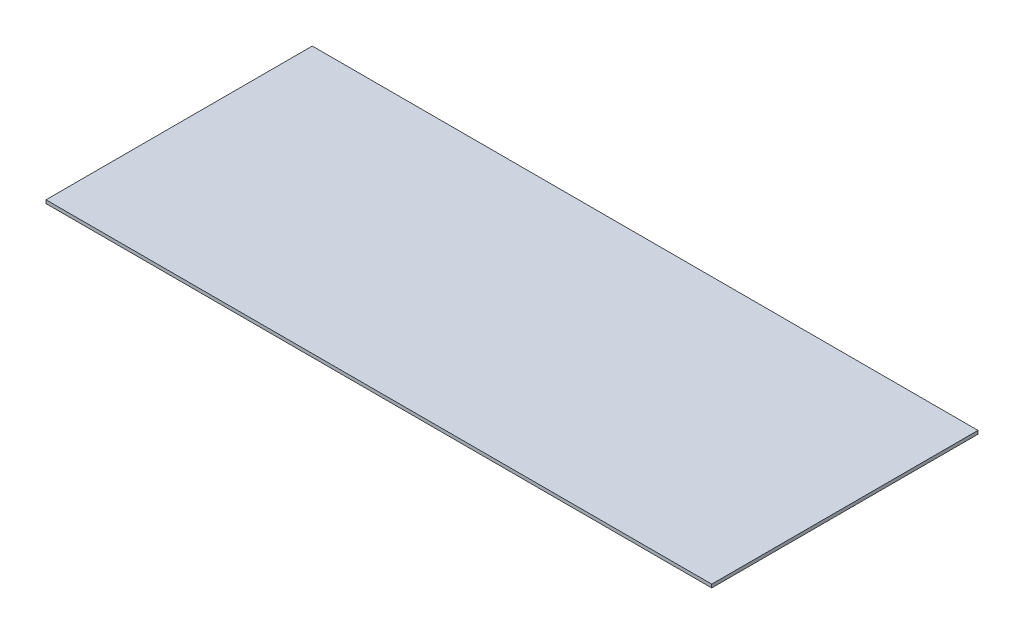
ISO-10303-21;
HEADER;
FILE_DESCRIPTION(('STEP AP214'),'2;1');
FILE_NAME('part.step','',(''),(''),'','','');
FILE_SCHEMA(('AUTOMOTIVE_DESIGN { 1 0 10303 214 1 1 1 1 }'));
ENDSEC;
DATA;
#1=APPLICATION_CONTEXT('core data for automotive mechanical design processes');
#2=APPLICATION_PROTOCOL_DEFINITION('international standard','automotive_design',2000,#1);
#3=PRODUCT_CONTEXT('',#1,'mechanical');
#4=PRODUCT('Part','Part','',(#3));
#5=PRODUCT_RELATED_PRODUCT_CATEGORY('part','',(#4));
#6=PRODUCT_DEFINITION_FORMATION('','',#4);
#7=PRODUCT_DEFINITION_CONTEXT('part definition',#1,'design');
#8=PRODUCT_DEFINITION('design','',#6,#7);
#9=PRODUCT_DEFINITION_SHAPE('','',#8);
#10=(LENGTH_UNIT() NAMED_UNIT(*) SI_UNIT(.MILLI.,.METRE.));
#11=(NAMED_UNIT(*) PLANE_ANGLE_UNIT() SI_UNIT($,.RADIAN.));
#12=(NAMED_UNIT(*) SI_UNIT($,.STERADIAN.) SOLID_ANGLE_UNIT());
#13=UNCERTAINTY_MEASURE_WITH_UNIT(LENGTH_MEASURE(1.E-05),#10,'distance_accuracy_value','');
#14=(GEOMETRIC_REPRESENTATION_CONTEXT(3) GLOBAL_UNCERTAINTY_ASSIGNED_CONTEXT((#13)) GLOBAL_UNIT_ASSIGNED_CONTEXT((#10,
#11,#12)) REPRESENTATION_CONTEXT('',''));
#15=CARTESIAN_POINT('',(0.,0.,0.));
#16=DIRECTION('',(0.,0.,1.));
#17=DIRECTION('',(1.,0.,0.));
#18=AXIS2_PLACEMENT_3D('',#15,#16,#17);
#19=CARTESIAN_POINT('',(-100.,1.,-40.));
#20=DIRECTION('',(1.,0.,0.));
#21=DIRECTION('',(0.,0.,-1.));
#22=AXIS2_PLACEMENT_3D('',#19,#20,#21);
#23=PLANE('',#22);
#24=DIRECTION('',(0.,0.,1.));
#25=VECTOR('',#24,1.);
#26=CARTESIAN_POINT('',(-100.,0.,-40.));
#27=LINE('',#26,#25);
#28=CARTESIAN_POINT('',(-100.,0.,-40.));
#29=VERTEX_POINT('',#28);
#30=CARTESIAN_POINT('',(-100.,0.,40.));
#31=VERTEX_POINT('',#30);
#32=EDGE_CURVE('E98',#29,#31,#27,.T.);
#33=ORIENTED_EDGE('',*,*,#32,.T.);
#34=DIRECTION('',(0.,-1.,0.));
#35=VECTOR('',#34,1.);
#36=CARTESIAN_POINT('',(-100.,1.,40.));
#37=LINE('',#36,#35);
#38=CARTESIAN_POINT('',(-100.,1.,40.));
#39=VERTEX_POINT('',#38);
#40=EDGE_CURVE('E11',#39,#31,#37,.T.);
#41=ORIENTED_EDGE('',*,*,#40,.F.);
#42=DIRECTION('',(0.,0.,1.));
#43=VECTOR('',#42,1.);
#44=CARTESIAN_POINT('',(-100.,1.,-40.));
#45=LINE('',#44,#43);
#46=CARTESIAN_POINT('',(-100.,1.,-40.));
#47=VERTEX_POINT('',#46);
#48=EDGE_CURVE('E86',#47,#39,#45,.T.);
#49=ORIENTED_EDGE('',*,*,#48,.F.);
#50=DIRECTION('',(0.,-1.,0.));
#51=VECTOR('',#50,1.);
#52=CARTESIAN_POINT('',(-100.,1.,-40.));
#53=LINE('',#52,#51);
#54=EDGE_CURVE('E94',#47,#29,#53,.T.);
#55=ORIENTED_EDGE('',*,*,#54,.T.);
#56=EDGE_LOOP('',(#33,#41,#49,#55));
#57=FACE_BOUND('',#56,.T.);
#58=ADVANCED_FACE('F35',(#57),#23,.F.);
#59=CARTESIAN_POINT('',(-100.,1.,40.));
#60=DIRECTION('',(0.,0.,-1.));
#61=DIRECTION('',(-1.,0.,0.));
#62=AXIS2_PLACEMENT_3D('',#59,#60,#61);
#63=PLANE('',#62);
#64=DIRECTION('',(1.,0.,0.));
#65=VECTOR('',#64,1.);
#66=CARTESIAN_POINT('',(-100.,0.,40.));
#67=LINE('',#66,#65);
#68=CARTESIAN_POINT('',(100.,0.,40.));
#69=VERTEX_POINT('',#68);
#70=EDGE_CURVE('E90',#31,#69,#67,.T.);
#71=ORIENTED_EDGE('',*,*,#70,.T.);
#72=DIRECTION('',(0.,-1.,0.));
#73=VECTOR('',#72,1.);
#74=CARTESIAN_POINT('',(100.,1.,40.));
#75=LINE('',#74,#73);
#76=CARTESIAN_POINT('',(100.,1.,40.));
#77=VERTEX_POINT('',#76);
#78=EDGE_CURVE('E43',#77,#69,#75,.T.);
#79=ORIENTED_EDGE('',*,*,#78,.F.);
#80=DIRECTION('',(1.,0.,0.));
#81=VECTOR('',#80,1.);
#82=CARTESIAN_POINT('',(-100.,1.,40.));
#83=LINE('',#82,#81);
#84=EDGE_CURVE('E81',#39,#77,#83,.T.);
#85=ORIENTED_EDGE('',*,*,#84,.F.);
#86=ORIENTED_EDGE('',*,*,#40,.T.);
#87=EDGE_LOOP('',(#71,#79,#85,#86));
#88=FACE_BOUND('',#87,.T.);
#89=ADVANCED_FACE('F89',(#88),#63,.F.);
#90=CARTESIAN_POINT('',(100.,1.,-40.));
#91=DIRECTION('',(-1.,0.,0.));
#92=DIRECTION('',(0.,0.,1.));
#93=AXIS2_PLACEMENT_3D('',#90,#91,#92);
#94=PLANE('',#93);
#95=DIRECTION('',(0.,0.,-1.));
#96=VECTOR('',#95,1.);
#97=CARTESIAN_POINT('',(100.,0.,-40.));
#98=LINE('',#97,#96);
#99=CARTESIAN_POINT('',(100.,0.,-40.));
#100=VERTEX_POINT('',#99);
#101=EDGE_CURVE('E68',#69,#100,#98,.T.);
#102=ORIENTED_EDGE('',*,*,#101,.T.);
#103=DIRECTION('',(0.,-1.,0.));
#104=VECTOR('',#103,1.);
#105=CARTESIAN_POINT('',(100.,1.,-40.));
#106=LINE('',#105,#104);
#107=CARTESIAN_POINT('',(100.,1.,-40.));
#108=VERTEX_POINT('',#107);
#109=EDGE_CURVE('E91',#108,#100,#106,.T.);
#110=ORIENTED_EDGE('',*,*,#109,.F.);
#111=DIRECTION('',(0.,0.,-1.));
#112=VECTOR('',#111,1.);
#113=CARTESIAN_POINT('',(100.,1.,-40.));
#114=LINE('',#113,#112);
#115=EDGE_CURVE('E84',#77,#108,#114,.T.);
#116=ORIENTED_EDGE('',*,*,#115,.F.);
#117=ORIENTED_EDGE('',*,*,#78,.T.);
#118=EDGE_LOOP('',(#102,#110,#116,#117));
#119=FACE_BOUND('',#118,.T.);
#120=ADVANCED_FACE('F92',(#119),#94,.F.);
#121=CARTESIAN_POINT('',(-100.,1.,-40.));
#122=DIRECTION('',(0.,0.,1.));
#123=DIRECTION('',(1.,0.,0.));
#124=AXIS2_PLACEMENT_3D('',#121,#122,#123);
#125=PLANE('',#124);
#126=DIRECTION('',(-1.,0.,0.));
#127=VECTOR('',#126,1.);
#128=CARTESIAN_POINT('',(-100.,0.,-40.));
#129=LINE('',#128,#127);
#130=EDGE_CURVE('E74',#100,#29,#129,.T.);
#131=ORIENTED_EDGE('',*,*,#130,.T.);
#132=ORIENTED_EDGE('',*,*,#54,.F.);
#133=DIRECTION('',(-1.,0.,0.));
#134=VECTOR('',#133,1.);
#135=CARTESIAN_POINT('',(-100.,1.,-40.));
#136=LINE('',#135,#134);
#137=EDGE_CURVE('E51',#108,#47,#136,.T.);
#138=ORIENTED_EDGE('',*,*,#137,.F.);
#139=ORIENTED_EDGE('',*,*,#109,.T.);
#140=EDGE_LOOP('',(#131,#132,#138,#139));
#141=FACE_BOUND('',#140,.T.);
#142=ADVANCED_FACE('F105',(#141),#125,.F.);
#143=CARTESIAN_POINT('',(0.,1.,0.));
#144=DIRECTION('',(0.,1.,0.));
#145=DIRECTION('',(0.,0.,1.));
#146=AXIS2_PLACEMENT_3D('',#143,#144,#145);
#147=PLANE('',#146);
#148=ORIENTED_EDGE('',*,*,#48,.T.);
#149=ORIENTED_EDGE('',*,*,#84,.T.);
#150=ORIENTED_EDGE('',*,*,#115,.T.);
#151=ORIENTED_EDGE('',*,*,#137,.T.);
#152=EDGE_LOOP('',(#148,#149,#150,#151));
#153=FACE_BOUND('',#152,.T.);
#154=ADVANCED_FACE('F82',(#153),#147,.T.);
#155=CARTESIAN_POINT('',(0.,0.,0.));
#156=DIRECTION('',(0.,1.,0.));
#157=DIRECTION('',(0.,0.,1.));
#158=AXIS2_PLACEMENT_3D('',#155,#156,#157);
#159=PLANE('',#158);
#160=ORIENTED_EDGE('',*,*,#32,.F.);
#161=ORIENTED_EDGE('',*,*,#130,.F.);
#162=ORIENTED_EDGE('',*,*,#101,.F.);
#163=ORIENTED_EDGE('',*,*,#70,.F.);
#164=EDGE_LOOP('',(#160,#161,#162,#163));
#165=FACE_BOUND('',#164,.T.);
#166=ADVANCED_FACE('F108',(#165),#159,.F.);
#167=CLOSED_SHELL('',(#58,#89,#120,#142,#154,#166));
#168=MANIFOLD_SOLID_BREP('B2',#167);
#169=ADVANCED_BREP_SHAPE_REPRESENTATION('',(#18,#168),#14);
#170=SHAPE_DEFINITION_REPRESENTATION(#9,#169);
ENDSEC;
END-ISO-10303-21;
